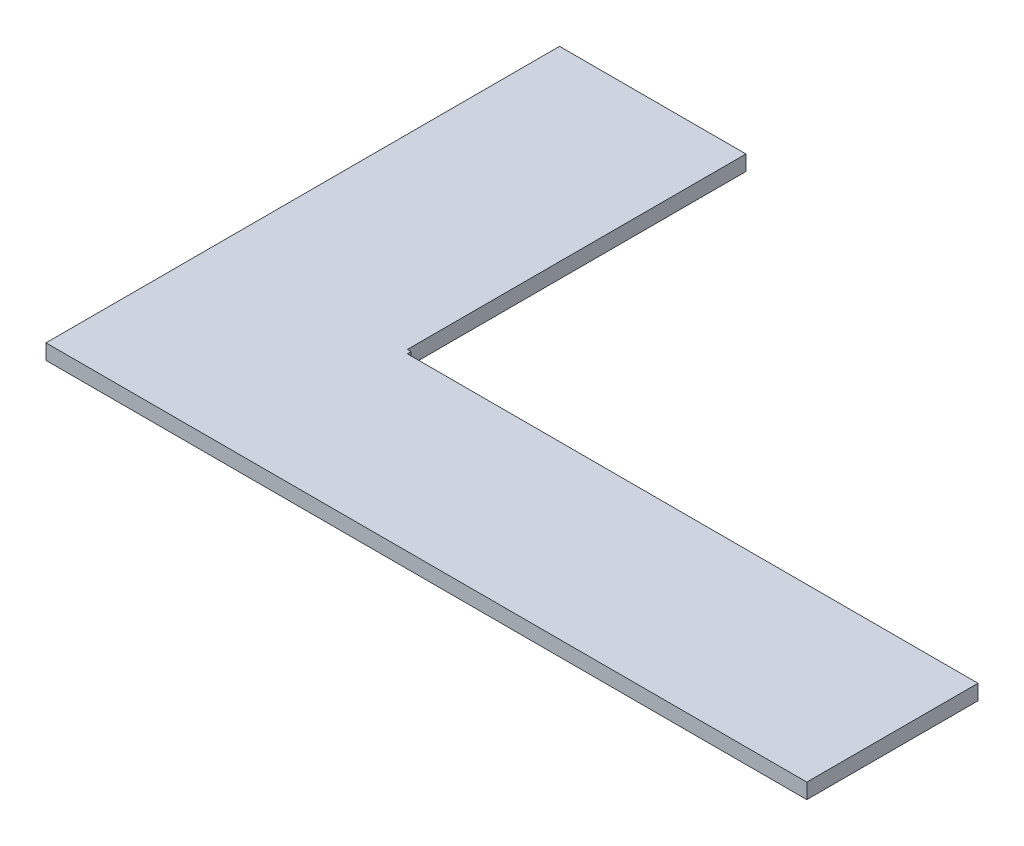
ISO-10303-21;
HEADER;
FILE_DESCRIPTION(('STEP AP214'),'2;1');
FILE_NAME('part.step','',(''),(''),'','','');
FILE_SCHEMA(('AUTOMOTIVE_DESIGN { 1 0 10303 214 1 1 1 1 }'));
ENDSEC;
DATA;
#1=APPLICATION_CONTEXT('core data for automotive mechanical design processes');
#2=APPLICATION_PROTOCOL_DEFINITION('international standard','automotive_design',2000,#1);
#3=PRODUCT_CONTEXT('',#1,'mechanical');
#4=PRODUCT('Part','Part','',(#3));
#5=PRODUCT_RELATED_PRODUCT_CATEGORY('part','',(#4));
#6=PRODUCT_DEFINITION_FORMATION('','',#4);
#7=PRODUCT_DEFINITION_CONTEXT('part definition',#1,'design');
#8=PRODUCT_DEFINITION('design','',#6,#7);
#9=PRODUCT_DEFINITION_SHAPE('','',#8);
#10=(LENGTH_UNIT() NAMED_UNIT(*) SI_UNIT(.MILLI.,.METRE.));
#11=(NAMED_UNIT(*) PLANE_ANGLE_UNIT() SI_UNIT($,.RADIAN.));
#12=(NAMED_UNIT(*) SI_UNIT($,.STERADIAN.) SOLID_ANGLE_UNIT());
#13=UNCERTAINTY_MEASURE_WITH_UNIT(LENGTH_MEASURE(1.E-05),#10,'distance_accuracy_value','');
#14=(GEOMETRIC_REPRESENTATION_CONTEXT(3) GLOBAL_UNCERTAINTY_ASSIGNED_CONTEXT((#13)) GLOBAL_UNIT_ASSIGNED_CONTEXT((#10,
#11,#12)) REPRESENTATION_CONTEXT('',''));
#15=CARTESIAN_POINT('',(0.,0.,0.));
#16=DIRECTION('',(0.,0.,1.));
#17=DIRECTION('',(1.,0.,0.));
#18=AXIS2_PLACEMENT_3D('',#15,#16,#17);
#19=CARTESIAN_POINT('',(0.,4.,-135.));
#20=DIRECTION('',(0.,0.,1.));
#21=DIRECTION('',(1.,0.,0.));
#22=AXIS2_PLACEMENT_3D('',#19,#20,#21);
#23=PLANE('',#22);
#24=DIRECTION('',(0.,1.,0.));
#25=VECTOR('',#24,1.);
#26=CARTESIAN_POINT('',(49.0000000000001,8.,-135.));
#27=LINE('',#26,#25);
#28=CARTESIAN_POINT('',(49.0000000000001,4.,-135.));
#29=VERTEX_POINT('',#28);
#30=CARTESIAN_POINT('',(49.0000000000001,8.,-135.));
#31=VERTEX_POINT('',#30);
#32=EDGE_CURVE('E116',#29,#31,#27,.T.);
#33=ORIENTED_EDGE('',*,*,#32,.F.);
#34=DIRECTION('',(1.,0.,0.));
#35=VECTOR('',#34,1.);
#36=CARTESIAN_POINT('',(0.,4.,-135.));
#37=LINE('',#36,#35);
#38=CARTESIAN_POINT('',(0.,4.,-135.));
#39=VERTEX_POINT('',#38);
#40=EDGE_CURVE('E163',#29,#39,#37,.F.);
#41=ORIENTED_EDGE('',*,*,#40,.T.);
#42=DIRECTION('',(0.,1.,0.));
#43=VECTOR('',#42,1.);
#44=CARTESIAN_POINT('',(0.,4.,-135.));
#45=LINE('',#44,#43);
#46=CARTESIAN_POINT('',(0.,8.,-135.));
#47=VERTEX_POINT('',#46);
#48=EDGE_CURVE('E11',#39,#47,#45,.T.);
#49=ORIENTED_EDGE('',*,*,#48,.T.);
#50=DIRECTION('',(1.,0.,0.));
#51=VECTOR('',#50,1.);
#52=CARTESIAN_POINT('',(0.,8.,-135.));
#53=LINE('',#52,#51);
#54=EDGE_CURVE('E128',#31,#47,#53,.F.);
#55=ORIENTED_EDGE('',*,*,#54,.F.);
#56=EDGE_LOOP('',(#33,#41,#49,#55));
#57=FACE_BOUND('',#56,.T.);
#58=ADVANCED_FACE('F38',(#57),#23,.F.);
#59=CARTESIAN_POINT('',(0.,4.,0.));
#60=DIRECTION('',(-1.,0.,0.));
#61=DIRECTION('',(0.,0.,1.));
#62=AXIS2_PLACEMENT_3D('',#59,#60,#61);
#63=PLANE('',#62);
#64=ORIENTED_EDGE('',*,*,#48,.F.);
#65=DIRECTION('',(0.,0.,1.));
#66=VECTOR('',#65,1.);
#67=CARTESIAN_POINT('',(0.,4.,0.));
#68=LINE('',#67,#66);
#69=CARTESIAN_POINT('',(0.,4.,0.));
#70=VERTEX_POINT('',#69);
#71=EDGE_CURVE('E159',#39,#70,#68,.T.);
#72=ORIENTED_EDGE('',*,*,#71,.T.);
#73=DIRECTION('',(0.,1.,0.));
#74=VECTOR('',#73,1.);
#75=CARTESIAN_POINT('',(0.,4.,0.));
#76=LINE('',#75,#74);
#77=CARTESIAN_POINT('',(0.,8.,0.));
#78=VERTEX_POINT('',#77);
#79=EDGE_CURVE('E48',#70,#78,#76,.T.);
#80=ORIENTED_EDGE('',*,*,#79,.T.);
#81=DIRECTION('',(0.,0.,1.));
#82=VECTOR('',#81,1.);
#83=CARTESIAN_POINT('',(0.,8.,0.));
#84=LINE('',#83,#82);
#85=EDGE_CURVE('E135',#47,#78,#84,.T.);
#86=ORIENTED_EDGE('',*,*,#85,.F.);
#87=EDGE_LOOP('',(#64,#72,#80,#86));
#88=FACE_BOUND('',#87,.T.);
#89=ADVANCED_FACE('F175',(#88),#63,.T.);
#90=CARTESIAN_POINT('',(0.,4.,0.));
#91=DIRECTION('',(0.,0.,1.));
#92=DIRECTION('',(1.,0.,0.));
#93=AXIS2_PLACEMENT_3D('',#90,#91,#92);
#94=PLANE('',#93);
#95=ORIENTED_EDGE('',*,*,#79,.F.);
#96=DIRECTION('',(1.,0.,0.));
#97=VECTOR('',#96,1.);
#98=CARTESIAN_POINT('',(0.,4.,0.));
#99=LINE('',#98,#97);
#100=CARTESIAN_POINT('',(200.,4.,0.));
#101=VERTEX_POINT('',#100);
#102=EDGE_CURVE('E155',#70,#101,#99,.T.);
#103=ORIENTED_EDGE('',*,*,#102,.T.);
#104=DIRECTION('',(0.,1.,0.));
#105=VECTOR('',#104,1.);
#106=CARTESIAN_POINT('',(200.,4.,0.));
#107=LINE('',#106,#105);
#108=CARTESIAN_POINT('',(200.,8.,0.));
#109=VERTEX_POINT('',#108);
#110=EDGE_CURVE('E170',#101,#109,#107,.T.);
#111=ORIENTED_EDGE('',*,*,#110,.T.);
#112=DIRECTION('',(1.,0.,0.));
#113=VECTOR('',#112,1.);
#114=CARTESIAN_POINT('',(0.,8.,0.));
#115=LINE('',#114,#113);
#116=EDGE_CURVE('E140',#78,#109,#115,.T.);
#117=ORIENTED_EDGE('',*,*,#116,.F.);
#118=EDGE_LOOP('',(#95,#103,#111,#117));
#119=FACE_BOUND('',#118,.T.);
#120=ADVANCED_FACE('F182',(#119),#94,.T.);
#121=CARTESIAN_POINT('',(200.,4.,0.));
#122=DIRECTION('',(-1.,0.,0.));
#123=DIRECTION('',(0.,0.,1.));
#124=AXIS2_PLACEMENT_3D('',#121,#122,#123);
#125=PLANE('',#124);
#126=ORIENTED_EDGE('',*,*,#110,.F.);
#127=DIRECTION('',(0.,0.,1.));
#128=VECTOR('',#127,1.);
#129=CARTESIAN_POINT('',(200.,4.,0.));
#130=LINE('',#129,#128);
#131=CARTESIAN_POINT('',(200.,4.,-45.0000000000001));
#132=VERTEX_POINT('',#131);
#133=EDGE_CURVE('E152',#101,#132,#130,.F.);
#134=ORIENTED_EDGE('',*,*,#133,.T.);
#135=DIRECTION('',(0.,1.,0.));
#136=VECTOR('',#135,1.);
#137=CARTESIAN_POINT('',(200.,4.,-45.0000000000001));
#138=LINE('',#137,#136);
#139=CARTESIAN_POINT('',(200.,8.,-45.0000000000001));
#140=VERTEX_POINT('',#139);
#141=EDGE_CURVE('E64',#132,#140,#138,.T.);
#142=ORIENTED_EDGE('',*,*,#141,.T.);
#143=DIRECTION('',(0.,0.,1.));
#144=VECTOR('',#143,1.);
#145=CARTESIAN_POINT('',(200.,8.,0.));
#146=LINE('',#145,#144);
#147=EDGE_CURVE('E184',#109,#140,#146,.F.);
#148=ORIENTED_EDGE('',*,*,#147,.F.);
#149=EDGE_LOOP('',(#126,#134,#142,#148));
#150=FACE_BOUND('',#149,.T.);
#151=ADVANCED_FACE('F207',(#150),#125,.F.);
#152=CARTESIAN_POINT('',(0.,4.,-45.0000000000001));
#153=DIRECTION('',(0.,0.,1.));
#154=DIRECTION('',(1.,0.,0.));
#155=AXIS2_PLACEMENT_3D('',#152,#153,#154);
#156=PLANE('',#155);
#157=ORIENTED_EDGE('',*,*,#141,.F.);
#158=DIRECTION('',(1.,0.,0.));
#159=VECTOR('',#158,1.);
#160=CARTESIAN_POINT('',(0.,4.,-45.0000000000001));
#161=LINE('',#160,#159);
#162=CARTESIAN_POINT('',(50.0000000000001,4.,-45.0000000000001));
#163=VERTEX_POINT('',#162);
#164=EDGE_CURVE('E146',#132,#163,#161,.F.);
#165=ORIENTED_EDGE('',*,*,#164,.T.);
#166=DIRECTION('',(0.,1.,0.));
#167=VECTOR('',#166,1.);
#168=CARTESIAN_POINT('',(50.0000000000001,4.,-45.0000000000001));
#169=LINE('',#168,#167);
#170=CARTESIAN_POINT('',(50.0000000000001,8.,-45.0000000000001));
#171=VERTEX_POINT('',#170);
#172=EDGE_CURVE('E42',#163,#171,#169,.T.);
#173=ORIENTED_EDGE('',*,*,#172,.T.);
#174=DIRECTION('',(1.,0.,0.));
#175=VECTOR('',#174,1.);
#176=CARTESIAN_POINT('',(0.,8.,-45.0000000000001));
#177=LINE('',#176,#175);
#178=EDGE_CURVE('E142',#140,#171,#177,.F.);
#179=ORIENTED_EDGE('',*,*,#178,.F.);
#180=EDGE_LOOP('',(#157,#165,#173,#179));
#181=FACE_BOUND('',#180,.T.);
#182=ADVANCED_FACE('F204',(#181),#156,.F.);
#183=CARTESIAN_POINT('',(50.0000000000001,4.,0.));
#184=DIRECTION('',(-1.,0.,0.));
#185=DIRECTION('',(0.,0.,1.));
#186=AXIS2_PLACEMENT_3D('',#183,#184,#185);
#187=PLANE('',#186);
#188=DIRECTION('',(0.,-1.,0.));
#189=VECTOR('',#188,1.);
#190=CARTESIAN_POINT('',(50.0000000000001,7.99999999999999,-46.0000000000001));
#191=LINE('',#190,#189);
#192=CARTESIAN_POINT('',(50.0000000000001,7.99999999999999,-46.0000000000001));
#193=VERTEX_POINT('',#192);
#194=CARTESIAN_POINT('',(50.0000000000001,4.,-46.0000000000001));
#195=VERTEX_POINT('',#194);
#196=EDGE_CURVE('E114',#193,#195,#191,.T.);
#197=ORIENTED_EDGE('',*,*,#196,.F.);
#198=DIRECTION('',(0.,0.,1.));
#199=VECTOR('',#198,1.);
#200=CARTESIAN_POINT('',(50.0000000000001,8.,0.));
#201=LINE('',#200,#199);
#202=EDGE_CURVE('E136',#171,#193,#201,.F.);
#203=ORIENTED_EDGE('',*,*,#202,.F.);
#204=ORIENTED_EDGE('',*,*,#172,.F.);
#205=DIRECTION('',(0.,0.,1.));
#206=VECTOR('',#205,1.);
#207=CARTESIAN_POINT('',(50.0000000000001,4.,0.));
#208=LINE('',#207,#206);
#209=EDGE_CURVE('E150',#163,#195,#208,.F.);
#210=ORIENTED_EDGE('',*,*,#209,.T.);
#211=EDGE_LOOP('',(#197,#203,#204,#210));
#212=FACE_BOUND('',#211,.T.);
#213=ADVANCED_FACE('F40',(#212),#187,.F.);
#214=CARTESIAN_POINT('',(0.,8.,0.));
#215=DIRECTION('',(0.,1.,0.));
#216=DIRECTION('',(0.,0.,1.));
#217=AXIS2_PLACEMENT_3D('',#214,#215,#216);
#218=PLANE('',#217);
#219=DIRECTION('',(1.,0.,0.));
#220=VECTOR('',#219,1.);
#221=CARTESIAN_POINT('',(49.0000000000001,7.99999999999999,-46.0000000000001));
#222=LINE('',#221,#220);
#223=CARTESIAN_POINT('',(49.0000000000001,7.99999999999999,-46.0000000000001));
#224=VERTEX_POINT('',#223);
#225=EDGE_CURVE('E112',#224,#193,#222,.T.);
#226=ORIENTED_EDGE('',*,*,#225,.F.);
#227=DIRECTION('',(0.,0.,1.));
#228=VECTOR('',#227,1.);
#229=CARTESIAN_POINT('',(49.0000000000001,8.,-135.));
#230=LINE('',#229,#228);
#231=EDGE_CURVE('E119',#31,#224,#230,.T.);
#232=ORIENTED_EDGE('',*,*,#231,.F.);
#233=ORIENTED_EDGE('',*,*,#54,.T.);
#234=ORIENTED_EDGE('',*,*,#85,.T.);
#235=ORIENTED_EDGE('',*,*,#116,.T.);
#236=ORIENTED_EDGE('',*,*,#147,.T.);
#237=ORIENTED_EDGE('',*,*,#178,.T.);
#238=ORIENTED_EDGE('',*,*,#202,.T.);
#239=EDGE_LOOP('',(#226,#232,#233,#234,#235,#236,#237,#238));
#240=FACE_BOUND('',#239,.T.);
#241=ADVANCED_FACE('F126',(#240),#218,.T.);
#242=CARTESIAN_POINT('',(0.,4.,0.));
#243=DIRECTION('',(0.,1.,0.));
#244=DIRECTION('',(0.,0.,1.));
#245=AXIS2_PLACEMENT_3D('',#242,#243,#244);
#246=PLANE('',#245);
#247=DIRECTION('',(0.,0.,-1.));
#248=VECTOR('',#247,1.);
#249=CARTESIAN_POINT('',(49.0000000000001,4.,-135.));
#250=LINE('',#249,#248);
#251=CARTESIAN_POINT('',(49.0000000000001,4.,-46.0000000000001));
#252=VERTEX_POINT('',#251);
#253=EDGE_CURVE('E102',#252,#29,#250,.T.);
#254=ORIENTED_EDGE('',*,*,#253,.F.);
#255=DIRECTION('',(1.,0.,0.));
#256=VECTOR('',#255,1.);
#257=CARTESIAN_POINT('',(49.0000000000001,4.,-46.0000000000001));
#258=LINE('',#257,#256);
#259=EDGE_CURVE('E151',#252,#195,#258,.T.);
#260=ORIENTED_EDGE('',*,*,#259,.T.);
#261=ORIENTED_EDGE('',*,*,#209,.F.);
#262=ORIENTED_EDGE('',*,*,#164,.F.);
#263=ORIENTED_EDGE('',*,*,#133,.F.);
#264=ORIENTED_EDGE('',*,*,#102,.F.);
#265=ORIENTED_EDGE('',*,*,#71,.F.);
#266=ORIENTED_EDGE('',*,*,#40,.F.);
#267=EDGE_LOOP('',(#254,#260,#261,#262,#263,#264,#265,#266));
#268=FACE_BOUND('',#267,.T.);
#269=ADVANCED_FACE('F201',(#268),#246,.F.);
#270=CARTESIAN_POINT('',(49.0000000000001,7.99999999999999,-46.0000000000001));
#271=DIRECTION('',(0.,0.,1.));
#272=DIRECTION('',(1.,0.,0.));
#273=AXIS2_PLACEMENT_3D('',#270,#271,#272);
#274=PLANE('',#273);
#275=ORIENTED_EDGE('',*,*,#196,.T.);
#276=ORIENTED_EDGE('',*,*,#259,.F.);
#277=DIRECTION('',(0.,-1.,0.));
#278=VECTOR('',#277,1.);
#279=CARTESIAN_POINT('',(49.0000000000001,7.99999999999999,-46.0000000000001));
#280=LINE('',#279,#278);
#281=EDGE_CURVE('E55',#224,#252,#280,.T.);
#282=ORIENTED_EDGE('',*,*,#281,.F.);
#283=ORIENTED_EDGE('',*,*,#225,.T.);
#284=EDGE_LOOP('',(#275,#276,#282,#283));
#285=FACE_BOUND('',#284,.T.);
#286=ADVANCED_FACE('F263',(#285),#274,.F.);
#287=CARTESIAN_POINT('',(49.0000000000001,0.,0.));
#288=DIRECTION('',(-1.,0.,0.));
#289=DIRECTION('',(0.,0.,1.));
#290=AXIS2_PLACEMENT_3D('',#287,#288,#289);
#291=PLANE('',#290);
#292=ORIENTED_EDGE('',*,*,#32,.T.);
#293=ORIENTED_EDGE('',*,*,#231,.T.);
#294=ORIENTED_EDGE('',*,*,#281,.T.);
#295=ORIENTED_EDGE('',*,*,#253,.T.);
#296=EDGE_LOOP('',(#292,#293,#294,#295));
#297=FACE_BOUND('',#296,.T.);
#298=ADVANCED_FACE('F118',(#297),#291,.F.);
#299=CLOSED_SHELL('',(#58,#89,#120,#151,#182,#213,#241,#269,#286,#298));
#300=MANIFOLD_SOLID_BREP('B2',#299);
#301=ADVANCED_BREP_SHAPE_REPRESENTATION('',(#18,#300),#14);
#302=SHAPE_DEFINITION_REPRESENTATION(#9,#301);
ENDSEC;
END-ISO-10303-21;
